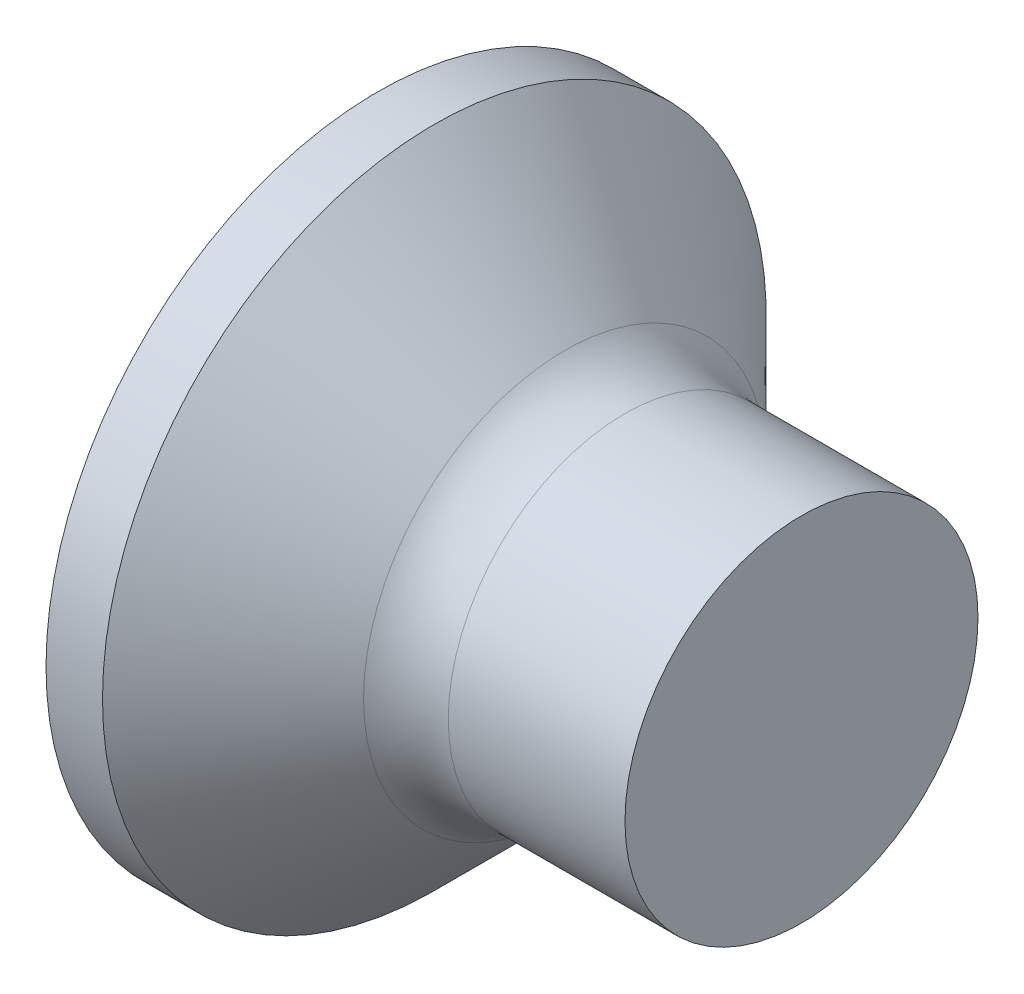
ISO-10303-21;
HEADER;
FILE_DESCRIPTION(('STEP AP214'),'2;1');
FILE_NAME('part.step','',(''),(''),'','','');
FILE_SCHEMA(('AUTOMOTIVE_DESIGN { 1 0 10303 214 1 1 1 1 }'));
ENDSEC;
DATA;
#1=APPLICATION_CONTEXT('core data for automotive mechanical design processes');
#2=APPLICATION_PROTOCOL_DEFINITION('international standard','automotive_design',2000,#1);
#3=PRODUCT_CONTEXT('',#1,'mechanical');
#4=PRODUCT('Part','Part','',(#3));
#5=PRODUCT_RELATED_PRODUCT_CATEGORY('part','',(#4));
#6=PRODUCT_DEFINITION_FORMATION('','',#4);
#7=PRODUCT_DEFINITION_CONTEXT('part definition',#1,'design');
#8=PRODUCT_DEFINITION('design','',#6,#7);
#9=PRODUCT_DEFINITION_SHAPE('','',#8);
#10=(LENGTH_UNIT() NAMED_UNIT(*) SI_UNIT(.MILLI.,.METRE.));
#11=(NAMED_UNIT(*) PLANE_ANGLE_UNIT() SI_UNIT($,.RADIAN.));
#12=(NAMED_UNIT(*) SI_UNIT($,.STERADIAN.) SOLID_ANGLE_UNIT());
#13=UNCERTAINTY_MEASURE_WITH_UNIT(LENGTH_MEASURE(1.E-05),#10,'distance_accuracy_value','');
#14=(GEOMETRIC_REPRESENTATION_CONTEXT(3) GLOBAL_UNCERTAINTY_ASSIGNED_CONTEXT((#13)) GLOBAL_UNIT_ASSIGNED_CONTEXT((#10,
#11,#12)) REPRESENTATION_CONTEXT('',''));
#15=CARTESIAN_POINT('',(0.,0.,0.));
#16=DIRECTION('',(0.,0.,1.));
#17=DIRECTION('',(1.,0.,0.));
#18=AXIS2_PLACEMENT_3D('',#15,#16,#17);
#19=CARTESIAN_POINT('',(1.73,0.,0.));
#20=DIRECTION('',(-1.,0.,0.));
#21=DIRECTION('',(0.,0.,1.));
#22=AXIS2_PLACEMENT_3D('',#19,#20,#21);
#23=CONICAL_SURFACE('',#22,0.556,0.0698131702740412);
#24=CARTESIAN_POINT('',(1.729999999998,-0.415013252800625,-0.37));
#25=CARTESIAN_POINT('',(1.55750312969354,-0.431158403107287,-0.37));
#26=CARTESIAN_POINT('',(1.3849709648995,-0.446919624190215,-0.37));
#27=CARTESIAN_POINT('',(1.03985338175011,-0.477835186856665,-0.37));
#28=CARTESIAN_POINT('',(0.867267963772219,-0.492989532646502,-0.37));
#29=CARTESIAN_POINT('',(0.57890193528168,-0.517935215013628,-0.37));
#30=CARTESIAN_POINT('',(0.463131863825282,-0.527849157578997,-0.37));
#31=CARTESIAN_POINT('',(0.231576539421596,-0.547504590399097,-0.37));
#32=CARTESIAN_POINT('',(0.115791286406975,-0.557246079860979,-0.37));
#33=CARTESIAN_POINT('',(3.84101987284656E-11,-0.566915305839198,-0.37));
#34=B_SPLINE_CURVE_WITH_KNOTS('',3,(#24,#25,#26,#27,#28,#29,#30,#31,#32,#33),.UNSPECIFIED.,.F.,
.F.,(4,2,2,2,4),(0.,0.519751041860774,1.03949848065009,1.38807974296449,1.73666260746019),.UNSPECIFIED.);
#35=CARTESIAN_POINT('',(1.73,-0.415013252766291,-0.370000000038301));
#36=VERTEX_POINT('',#35);
#37=CARTESIAN_POINT('',(1.92040355908633E-11,-0.566915305840776,-0.37));
#38=VERTEX_POINT('',#37);
#39=EDGE_CURVE('E151',#36,#38,#34,.T.);
#40=ORIENTED_EDGE('',*,*,#39,.F.);
#41=CARTESIAN_POINT('',(1.73000000000001,0.,0.));
#42=DIRECTION('',(-1.,0.,0.));
#43=DIRECTION('',(0.,0.,1.));
#44=AXIS2_PLACEMENT_3D('',#41,#42,#43);
#45=CIRCLE('',#44,0.556);
#46=CARTESIAN_POINT('',(1.72999999999915,-0.370000000043595,-0.415013252761651));
#47=VERTEX_POINT('',#46);
#48=EDGE_CURVE('E154',#36,#47,#45,.F.);
#49=ORIENTED_EDGE('',*,*,#48,.T.);
#50=CARTESIAN_POINT('',(3.8564639094538E-11,-0.37,-0.566915305839159));
#51=CARTESIAN_POINT('',(0.210211798320362,-0.37,-0.549344413817544));
#52=CARTESIAN_POINT('',(0.420407070936408,-0.37,-0.53156443555399));
#53=CARTESIAN_POINT('',(0.840738581781578,-0.37,-0.495346236890955));
#54=CARTESIAN_POINT('',(1.05087482059881,-0.37,-0.476908023301598));
#55=CARTESIAN_POINT('',(1.33915479988444,-0.37,-0.450991756887927));
#56=CARTESIAN_POINT('',(1.41733328871563,-0.37,-0.443900811078467));
#57=CARTESIAN_POINT('',(1.57367713363391,-0.37,-0.429572412899283));
#58=CARTESIAN_POINT('',(1.65184248966971,-0.37,-0.422334959970157));
#59=CARTESIAN_POINT('',(1.7299999999983,-0.37,-0.41501325280067));
#60=B_SPLINE_CURVE_WITH_KNOTS('',3,(#50,#51,#52,#53,#54,#55,#56,#57,#58,#59),.UNSPECIFIED.,.F.,
.F.,(4,2,2,2,4),(0.,0.632836028032518,1.26566551061755,1.50116361532924,1.73666261940211),.UNSPECIFIED.);
#61=CARTESIAN_POINT('',(0.,-0.37,-0.566915305842379));
#62=VERTEX_POINT('',#61);
#63=EDGE_CURVE('E173',#62,#47,#60,.T.);
#64=ORIENTED_EDGE('',*,*,#63,.F.);
#65=CARTESIAN_POINT('',(0.,0.,0.));
#66=DIRECTION('',(-1.,0.,0.));
#67=DIRECTION('',(0.,0.,1.));
#68=AXIS2_PLACEMENT_3D('',#65,#66,#67);
#69=CIRCLE('',#68,0.676973385);
#70=EDGE_CURVE('E21',#62,#38,#69,.T.);
#71=ORIENTED_EDGE('',*,*,#70,.T.);
#72=EDGE_LOOP('',(#40,#49,#64,#71));
#73=FACE_BOUND('',#72,.T.);
#74=ADVANCED_FACE('F17',(#73),#23,.F.);
#75=CARTESIAN_POINT('',(0.,-1.40590992,-0.37));
#76=DIRECTION('',(0.,0.,1.));
#77=DIRECTION('',(1.,0.,0.));
#78=AXIS2_PLACEMENT_3D('',#75,#76,#77);
#79=PLANE('',#78);
#80=DIRECTION('',(0.,1.,0.));
#81=VECTOR('',#80,1.);
#82=CARTESIAN_POINT('',(1.73,-0.907506626,-0.37));
#83=LINE('',#82,#81);
#84=CARTESIAN_POINT('',(1.72999999997964,-0.537453962163108,-0.37));
#85=VERTEX_POINT('',#84);
#86=EDGE_CURVE('E153',#85,#36,#83,.T.);
#87=ORIENTED_EDGE('',*,*,#86,.T.);
#88=ORIENTED_EDGE('',*,*,#39,.T.);
#89=DIRECTION('',(0.,-1.,0.));
#90=VECTOR('',#89,1.);
#91=CARTESIAN_POINT('',(0.,-0.907506626,-0.37));
#92=LINE('',#91,#90);
#93=CARTESIAN_POINT('',(4.83501043022083E-11,-1.39999999973373,-0.37));
#94=VERTEX_POINT('',#93);
#95=EDGE_CURVE('E146',#38,#94,#92,.T.);
#96=ORIENTED_EDGE('',*,*,#95,.T.);
#97=DIRECTION('',(-0.894934391333905,-0.446197753476879,0.));
#98=VECTOR('',#97,1.);
#99=CARTESIAN_POINT('',(0.865,-0.968726981,-0.37));
#100=LINE('',#99,#98);
#101=EDGE_CURVE('E149',#85,#94,#100,.T.);
#102=ORIENTED_EDGE('',*,*,#101,.F.);
#103=EDGE_LOOP('',(#87,#88,#96,#102));
#104=FACE_BOUND('',#103,.T.);
#105=ADVANCED_FACE('F148',(#104),#79,.T.);
#106=CARTESIAN_POINT('',(0.,-0.37,-1.40590992));
#107=DIRECTION('',(0.,1.,0.));
#108=DIRECTION('',(0.,0.,1.));
#109=AXIS2_PLACEMENT_3D('',#106,#107,#108);
#110=PLANE('',#109);
#111=DIRECTION('',(0.,0.,1.));
#112=VECTOR('',#111,1.);
#113=CARTESIAN_POINT('',(0.,-0.37,-0.907506626));
#114=LINE('',#113,#112);
#115=CARTESIAN_POINT('',(0.,-0.37,-1.39999999975784));
#116=VERTEX_POINT('',#115);
#117=EDGE_CURVE('E139',#116,#62,#114,.T.);
#118=ORIENTED_EDGE('',*,*,#117,.T.);
#119=ORIENTED_EDGE('',*,*,#63,.T.);
#120=DIRECTION('',(0.,0.,-1.));
#121=VECTOR('',#120,1.);
#122=CARTESIAN_POINT('',(1.73,-0.37,-0.907506626));
#123=LINE('',#122,#121);
#124=CARTESIAN_POINT('',(1.73,-0.37,-0.537453962152957));
#125=VERTEX_POINT('',#124);
#126=EDGE_CURVE('E189',#47,#125,#123,.T.);
#127=ORIENTED_EDGE('',*,*,#126,.T.);
#128=DIRECTION('',(0.894934391333905,0.,0.446197753476879));
#129=VECTOR('',#128,1.);
#130=CARTESIAN_POINT('',(0.865,-0.37,-0.968726981));
#131=LINE('',#130,#129);
#132=EDGE_CURVE('E182',#116,#125,#131,.T.);
#133=ORIENTED_EDGE('',*,*,#132,.F.);
#134=EDGE_LOOP('',(#118,#119,#127,#133));
#135=FACE_BOUND('',#134,.T.);
#136=ADVANCED_FACE('F405',(#135),#110,.T.);
#137=CARTESIAN_POINT('',(1.73,-0.537453962,-0.37));
#138=DIRECTION('',(-0.446197753476879,0.894934391333905,0.));
#139=DIRECTION('',(-0.894934391333905,-0.446197753476879,0.));
#140=AXIS2_PLACEMENT_3D('',#137,#138,#139);
#141=PLANE('',#140);
#142=DIRECTION('',(0.,0.,-1.));
#143=VECTOR('',#142,1.);
#144=CARTESIAN_POINT('',(1.73,-0.537453962,0.));
#145=LINE('',#144,#143);
#146=CARTESIAN_POINT('',(1.73000000000001,-0.537453962182154,-0.142405191389582));
#147=VERTEX_POINT('',#146);
#148=EDGE_CURVE('E163',#147,#85,#145,.T.);
#149=ORIENTED_EDGE('',*,*,#148,.T.);
#150=ORIENTED_EDGE('',*,*,#101,.T.);
#151=DIRECTION('',(0.,0.,1.));
#152=VECTOR('',#151,1.);
#153=CARTESIAN_POINT('',(0.,-1.4,0.));
#154=LINE('',#153,#152);
#155=CARTESIAN_POINT('',(0.,-1.39999999963675,0.37));
#156=VERTEX_POINT('',#155);
#157=EDGE_CURVE('E160',#94,#156,#154,.T.);
#158=ORIENTED_EDGE('',*,*,#157,.T.);
#159=DIRECTION('',(-0.894934391578762,-0.44619775298577,0.));
#160=VECTOR('',#159,1.);
#161=CARTESIAN_POINT('',(1.73,-0.53745396245887,0.37));
#162=LINE('',#161,#160);
#163=CARTESIAN_POINT('',(1.73,-0.537453962229435,0.37));
#164=VERTEX_POINT('',#163);
#165=EDGE_CURVE('E376',#164,#156,#162,.T.);
#166=ORIENTED_EDGE('',*,*,#165,.F.);
#167=DIRECTION('',(0.,0.,-1.));
#168=VECTOR('',#167,1.);
#169=CARTESIAN_POINT('',(1.73,-0.537453962,0.));
#170=LINE('',#169,#168);
#171=CARTESIAN_POINT('',(1.73,-0.537453962165734,0.142405191451554));
#172=VERTEX_POINT('',#171);
#173=EDGE_CURVE('E172',#164,#172,#170,.T.);
#174=ORIENTED_EDGE('',*,*,#173,.T.);
#175=CARTESIAN_POINT('',(2.67005397689074,-0.0687604167553468,0.));
#176=DIRECTION('',(-0.446197753476879,0.894934391333905,0.));
#177=DIRECTION('',(-0.894934391333905,-0.446197753476879,0.));
#178=AXIS2_PLACEMENT_3D('',#175,#176,#177);
#179=ELLIPSE('',#178,1.09876172830792,0.485419189775482);
#180=EDGE_CURVE('E175',#172,#147,#179,.F.);
#181=ORIENTED_EDGE('',*,*,#180,.T.);
#182=EDGE_LOOP('',(#149,#150,#158,#166,#174,#181));
#183=FACE_BOUND('',#182,.T.);
#184=ADVANCED_FACE('F158',(#183),#141,.T.);
#185=CARTESIAN_POINT('',(0.,-0.37,-1.4));
#186=DIRECTION('',(-0.446197753476879,0.,0.894934391333905));
#187=DIRECTION('',(0.894934391333905,0.,0.446197753476879));
#188=AXIS2_PLACEMENT_3D('',#185,#186,#187);
#189=PLANE('',#188);
#190=DIRECTION('',(0.,1.,0.));
#191=VECTOR('',#190,1.);
#192=CARTESIAN_POINT('',(1.73,0.,-0.537453962));
#193=LINE('',#192,#191);
#194=CARTESIAN_POINT('',(1.73000000000001,0.142405191444702,-0.537453962167549));
#195=VERTEX_POINT('',#194);
#196=CARTESIAN_POINT('',(1.73,0.37,-0.537453962229435));
#197=VERTEX_POINT('',#196);
#198=EDGE_CURVE('E379',#195,#197,#193,.T.);
#199=ORIENTED_EDGE('',*,*,#198,.T.);
#200=DIRECTION('',(0.894934391578762,0.,0.44619775298577));
#201=VECTOR('',#200,1.);
#202=CARTESIAN_POINT('',(0.,0.37,-1.39999999927351));
#203=LINE('',#202,#201);
#204=CARTESIAN_POINT('',(0.,0.37,-1.39999999963675));
#205=VERTEX_POINT('',#204);
#206=EDGE_CURVE('E372',#205,#197,#203,.T.);
#207=ORIENTED_EDGE('',*,*,#206,.F.);
#208=DIRECTION('',(0.,-1.,0.));
#209=VECTOR('',#208,1.);
#210=CARTESIAN_POINT('',(0.,0.,-1.4));
#211=LINE('',#210,#209);
#212=EDGE_CURVE('E165',#205,#116,#211,.T.);
#213=ORIENTED_EDGE('',*,*,#212,.T.);
#214=ORIENTED_EDGE('',*,*,#132,.T.);
#215=DIRECTION('',(0.,1.,0.));
#216=VECTOR('',#215,1.);
#217=CARTESIAN_POINT('',(1.73,0.,-0.537453962));
#218=LINE('',#217,#216);
#219=CARTESIAN_POINT('',(1.73000000000001,-0.142405191396442,-0.537453962180336));
#220=VERTEX_POINT('',#219);
#221=EDGE_CURVE('E185',#125,#220,#218,.T.);
#222=ORIENTED_EDGE('',*,*,#221,.T.);
#223=CARTESIAN_POINT('',(2.67005397689074,0.,-0.0687604167553468));
#224=DIRECTION('',(-0.446197753476879,0.,0.894934391333905));
#225=DIRECTION('',(-0.894934391333905,0.,-0.446197753476879));
#226=AXIS2_PLACEMENT_3D('',#223,#224,#225);
#227=ELLIPSE('',#226,1.09876172830792,0.485419189775482);
#228=EDGE_CURVE('E381',#220,#195,#227,.F.);
#229=ORIENTED_EDGE('',*,*,#228,.T.);
#230=EDGE_LOOP('',(#199,#207,#213,#214,#222,#229));
#231=FACE_BOUND('',#230,.T.);
#232=ADVANCED_FACE('F424',(#231),#189,.T.);
#233=CARTESIAN_POINT('',(0.,-1.40590992,0.37));
#234=DIRECTION('',(0.,0.,-1.));
#235=DIRECTION('',(0.,1.,0.));
#236=AXIS2_PLACEMENT_3D('',#233,#234,#235);
#237=PLANE('',#236);
#238=DIRECTION('',(0.,1.,0.));
#239=VECTOR('',#238,1.);
#240=CARTESIAN_POINT('',(0.,-0.907506626,0.37));
#241=LINE('',#240,#239);
#242=CARTESIAN_POINT('',(1.22135406838788E-11,-0.566915305841359,0.37));
#243=VERTEX_POINT('',#242);
#244=EDGE_CURVE('E171',#156,#243,#241,.T.);
#245=ORIENTED_EDGE('',*,*,#244,.T.);
#246=CARTESIAN_POINT('',(1.73000000000188,-0.415013252800262,0.37));
#247=CARTESIAN_POINT('',(1.5575031296975,-0.431158403106922,0.37));
#248=CARTESIAN_POINT('',(1.38497096490355,-0.446919624189848,0.37));
#249=CARTESIAN_POINT('',(1.03985338175432,-0.477835186856293,0.37));
#250=CARTESIAN_POINT('',(0.867267963776517,-0.492989532646126,0.37));
#251=CARTESIAN_POINT('',(0.578901935283002,-0.517935215013516,0.37));
#252=CARTESIAN_POINT('',(0.463131863823544,-0.527849157579147,0.37));
#253=CARTESIAN_POINT('',(0.231576539413737,-0.547504590399762,0.37));
#254=CARTESIAN_POINT('',(0.115791286396055,-0.557246079861896,0.37));
#255=CARTESIAN_POINT('',(2.44294313152273E-11,-0.566915305840365,0.37));
#256=B_SPLINE_CURVE_WITH_KNOTS('',3,(#246,#247,#248,#249,#250,#251,#252,#253,#254,#255),
.UNSPECIFIED.,.F.,.F.,(4,2,2,2,4),(0.,0.519751041860521,1.03949848064959,1.3880797429732,
1.73666260747812),.UNSPECIFIED.);
#257=CARTESIAN_POINT('',(1.73,-0.415013252723627,0.370000000086156));
#258=VERTEX_POINT('',#257);
#259=EDGE_CURVE('E369',#258,#243,#256,.T.);
#260=ORIENTED_EDGE('',*,*,#259,.F.);
#261=DIRECTION('',(0.,-1.,0.));
#262=VECTOR('',#261,1.);
#263=CARTESIAN_POINT('',(1.73,-0.907506626,0.37));
#264=LINE('',#263,#262);
#265=EDGE_CURVE('E377',#258,#164,#264,.T.);
#266=ORIENTED_EDGE('',*,*,#265,.T.);
#267=ORIENTED_EDGE('',*,*,#165,.T.);
#268=EDGE_LOOP('',(#245,#260,#266,#267));
#269=FACE_BOUND('',#268,.T.);
#270=ADVANCED_FACE('F428',(#269),#237,.T.);
#271=CARTESIAN_POINT('',(0.,0.37,-0.409103332));
#272=DIRECTION('',(0.,-1.,0.));
#273=DIRECTION('',(0.,0.,-1.));
#274=AXIS2_PLACEMENT_3D('',#271,#272,#273);
#275=PLANE('',#274);
#276=DIRECTION('',(0.,0.,1.));
#277=VECTOR('',#276,1.);
#278=CARTESIAN_POINT('',(1.73,0.37,-0.907506626));
#279=LINE('',#278,#277);
#280=CARTESIAN_POINT('',(1.73,0.370000000080861,-0.415013252728347));
#281=VERTEX_POINT('',#280);
#282=EDGE_CURVE('E370',#197,#281,#279,.T.);
#283=ORIENTED_EDGE('',*,*,#282,.T.);
#284=CARTESIAN_POINT('',(2.41138960563302E-11,0.37,-0.566915305840366));
#285=CARTESIAN_POINT('',(0.210211798306226,0.37,-0.549344413818736));
#286=CARTESIAN_POINT('',(0.420407070922587,0.37,-0.531564435555168));
#287=CARTESIAN_POINT('',(0.840738581768387,0.37,-0.495346236892106));
#288=CARTESIAN_POINT('',(1.05087482058593,0.37,-0.476908023302737));
#289=CARTESIAN_POINT('',(1.3391547998745,0.37,-0.450991756888827));
#290=CARTESIAN_POINT('',(1.41733328870831,0.37,-0.443900811079136));
#291=CARTESIAN_POINT('',(1.57367713363182,0.37,-0.429572412899478));
#292=CARTESIAN_POINT('',(1.65184248967024,0.37,-0.42233495997011));
#293=CARTESIAN_POINT('',(1.73000000000145,0.37,-0.415013252800375));
#294=B_SPLINE_CURVE_WITH_KNOTS('',3,(#284,#285,#286,#287,#288,#289,#290,#291,#292,#293),
.UNSPECIFIED.,.F.,.F.,(4,2,2,2,4),(0.,0.632836028033464,1.26566551061944,1.50116361533902,
1.73666261941977),.UNSPECIFIED.);
#295=CARTESIAN_POINT('',(0.,0.37,-0.566915305842379));
#296=VERTEX_POINT('',#295);
#297=EDGE_CURVE('E366',#296,#281,#294,.T.);
#298=ORIENTED_EDGE('',*,*,#297,.F.);
#299=DIRECTION('',(0.,0.,-1.));
#300=VECTOR('',#299,1.);
#301=CARTESIAN_POINT('',(0.,0.37,-0.907506626));
#302=LINE('',#301,#300);
#303=EDGE_CURVE('E373',#296,#205,#302,.T.);
#304=ORIENTED_EDGE('',*,*,#303,.T.);
#305=ORIENTED_EDGE('',*,*,#206,.T.);
#306=EDGE_LOOP('',(#283,#298,#304,#305));
#307=FACE_BOUND('',#306,.T.);
#308=ADVANCED_FACE('F435',(#307),#275,.T.);
#309=CARTESIAN_POINT('',(1.73,0.,0.));
#310=DIRECTION('',(-1.,0.,0.));
#311=DIRECTION('',(0.,0.,1.));
#312=AXIS2_PLACEMENT_3D('',#309,#310,#311);
#313=CONICAL_SURFACE('',#312,0.556,0.0698131702740412);
#314=ORIENTED_EDGE('',*,*,#259,.T.);
#315=CARTESIAN_POINT('',(0.,0.,0.));
#316=DIRECTION('',(-1.,0.,0.));
#317=DIRECTION('',(0.,0.,1.));
#318=AXIS2_PLACEMENT_3D('',#315,#316,#317);
#319=CIRCLE('',#318,0.676973385);
#320=CARTESIAN_POINT('',(2.16429129721368E-11,-0.37,0.566915305840572));
#321=VERTEX_POINT('',#320);
#322=EDGE_CURVE('E446',#243,#321,#319,.T.);
#323=ORIENTED_EDGE('',*,*,#322,.T.);
#324=CARTESIAN_POINT('',(1.72999999998696,-0.37,0.415013252801659));
#325=CARTESIAN_POINT('',(1.55750312968226,-0.37,0.431158403108326));
#326=CARTESIAN_POINT('',(1.38497096488798,-0.37,0.446919624191261));
#327=CARTESIAN_POINT('',(1.03985338173811,-0.37,0.477835186857727));
#328=CARTESIAN_POINT('',(0.867267963759975,-0.37,0.492989532647572));
#329=CARTESIAN_POINT('',(0.578901935272125,-0.37,0.517935215014448));
#330=CARTESIAN_POINT('',(0.463131863818658,-0.37,0.527849157579561));
#331=CARTESIAN_POINT('',(0.231576539420833,-0.37,0.54750459039916));
#332=CARTESIAN_POINT('',(0.115791286409143,-0.37,0.557246079860795));
#333=CARTESIAN_POINT('',(4.35104937894774E-11,-0.37,0.566915305838772));
#334=B_SPLINE_CURVE_WITH_KNOTS('',3,(#324,#325,#326,#327,#328,#329,#330,#331,#332,#333),
.UNSPECIFIED.,.F.,.F.,(4,2,2,2,4),(0.,0.519751041861496,1.03949848065153,1.38807974295711,
1.73666260744399),.UNSPECIFIED.);
#335=CARTESIAN_POINT('',(1.72999999999349,-0.36999999999574,0.415013252804846));
#336=VERTEX_POINT('',#335);
#337=EDGE_CURVE('E351',#336,#321,#334,.T.);
#338=ORIENTED_EDGE('',*,*,#337,.F.);
#339=CARTESIAN_POINT('',(1.73000000000001,0.,0.));
#340=DIRECTION('',(-1.,0.,0.));
#341=DIRECTION('',(0.,0.,1.));
#342=AXIS2_PLACEMENT_3D('',#339,#340,#341);
#343=CIRCLE('',#342,0.556);
#344=EDGE_CURVE('E367',#336,#258,#343,.F.);
#345=ORIENTED_EDGE('',*,*,#344,.T.);
#346=EDGE_LOOP('',(#314,#323,#338,#345));
#347=FACE_BOUND('',#346,.T.);
#348=ADVANCED_FACE('F412',(#347),#313,.F.);
#349=CARTESIAN_POINT('',(1.73,0.,0.));
#350=DIRECTION('',(-1.,0.,0.));
#351=DIRECTION('',(0.,0.,1.));
#352=AXIS2_PLACEMENT_3D('',#349,#350,#351);
#353=CONICAL_SURFACE('',#352,0.556,0.0698131702740412);
#354=CARTESIAN_POINT('',(3.72916180636838E-11,0.566915305765091,-0.36999999986375));
#355=CARTESIAN_POINT('',(0.210211798323191,0.549344413791461,-0.369999999952531));
#356=CARTESIAN_POINT('',(0.420407070940878,0.531564435546869,-0.36999999998762));
#357=CARTESIAN_POINT('',(0.840738581787213,0.495346236897205,-0.37000000001238));
#358=CARTESIAN_POINT('',(1.05087482060397,0.476908023302259,-0.370000000002053));
#359=CARTESIAN_POINT('',(1.33915479988823,0.450991756887168,-0.369999999999236));
#360=CARTESIAN_POINT('',(1.4173332887182,0.443900811078025,-0.369999999999618));
#361=CARTESIAN_POINT('',(1.57367713363404,0.429572412899479,-0.370000000000382));
#362=CARTESIAN_POINT('',(1.65184248966863,0.422334959970673,-0.370000000000764));
#363=CARTESIAN_POINT('',(1.72999999999595,0.41501325280089,-0.37));
#364=B_SPLINE_CURVE_WITH_KNOTS('',3,(#354,#355,#356,#357,#358,#359,#360,#361,#362,#363),
.UNSPECIFIED.,.F.,.F.,(4,2,2,2,4),(0.,0.63283602803262,1.26566551061764,1.5011636153256,
1.73666261939476),.UNSPECIFIED.);
#365=CARTESIAN_POINT('',(0.,0.566915305842379,-0.37));
#366=VERTEX_POINT('',#365);
#367=CARTESIAN_POINT('',(1.72999999999798,0.415013252799705,-0.370000000001035));
#368=VERTEX_POINT('',#367);
#369=EDGE_CURVE('E336',#366,#368,#364,.T.);
#370=ORIENTED_EDGE('',*,*,#369,.F.);
#371=CARTESIAN_POINT('',(0.,0.,0.));
#372=DIRECTION('',(-1.,0.,0.));
#373=DIRECTION('',(0.,0.,1.));
#374=AXIS2_PLACEMENT_3D('',#371,#372,#373);
#375=CIRCLE('',#374,0.676973385);
#376=EDGE_CURVE('E357',#366,#296,#375,.T.);
#377=ORIENTED_EDGE('',*,*,#376,.T.);
#378=ORIENTED_EDGE('',*,*,#297,.T.);
#379=CARTESIAN_POINT('',(1.73000000000001,0.,0.));
#380=DIRECTION('',(-1.,0.,0.));
#381=DIRECTION('',(0.,0.,1.));
#382=AXIS2_PLACEMENT_3D('',#379,#380,#381);
#383=CIRCLE('',#382,0.556);
#384=EDGE_CURVE('E364',#281,#368,#383,.F.);
#385=ORIENTED_EDGE('',*,*,#384,.T.);
#386=EDGE_LOOP('',(#370,#377,#378,#385));
#387=FACE_BOUND('',#386,.T.);
#388=ADVANCED_FACE('F480',(#387),#353,.F.);
#389=CARTESIAN_POINT('',(0.,-0.37,0.409103332));
#390=DIRECTION('',(0.,1.,0.));
#391=DIRECTION('',(0.,0.,1.));
#392=AXIS2_PLACEMENT_3D('',#389,#390,#391);
#393=PLANE('',#392);
#394=DIRECTION('',(0.,0.,-1.));
#395=VECTOR('',#394,1.);
#396=CARTESIAN_POINT('',(1.73,-0.37,0.4758662855));
#397=LINE('',#396,#395);
#398=CARTESIAN_POINT('',(1.72999999997964,-0.37,0.537453962010151));
#399=VERTEX_POINT('',#398);
#400=EDGE_CURVE('E326',#399,#336,#397,.T.);
#401=ORIENTED_EDGE('',*,*,#400,.T.);
#402=ORIENTED_EDGE('',*,*,#337,.T.);
#403=DIRECTION('',(0.,0.,1.));
#404=VECTOR('',#403,1.);
#405=CARTESIAN_POINT('',(0.,-0.37,0.907506626));
#406=LINE('',#405,#404);
#407=CARTESIAN_POINT('',(4.83501043022083E-11,-0.37,1.39999999973373));
#408=VERTEX_POINT('',#407);
#409=EDGE_CURVE('E354',#321,#408,#406,.T.);
#410=ORIENTED_EDGE('',*,*,#409,.T.);
#411=DIRECTION('',(-0.894934391333905,0.,0.446197753476879));
#412=VECTOR('',#411,1.);
#413=CARTESIAN_POINT('',(0.865,-0.37,0.968726981));
#414=LINE('',#413,#412);
#415=EDGE_CURVE('E316',#399,#408,#414,.T.);
#416=ORIENTED_EDGE('',*,*,#415,.F.);
#417=EDGE_LOOP('',(#401,#402,#410,#416));
#418=FACE_BOUND('',#417,.T.);
#419=ADVANCED_FACE('F483',(#418),#393,.T.);
#420=CARTESIAN_POINT('',(0.,0.409103332,-0.37));
#421=DIRECTION('',(0.,0.,1.));
#422=DIRECTION('',(1.,0.,0.));
#423=AXIS2_PLACEMENT_3D('',#420,#421,#422);
#424=PLANE('',#423);
#425=DIRECTION('',(0.,-1.,0.));
#426=VECTOR('',#425,1.);
#427=CARTESIAN_POINT('',(0.,0.907506626,-0.37));
#428=LINE('',#427,#426);
#429=CARTESIAN_POINT('',(0.,1.39999999975784,-0.37));
#430=VERTEX_POINT('',#429);
#431=EDGE_CURVE('E344',#430,#366,#428,.T.);
#432=ORIENTED_EDGE('',*,*,#431,.T.);
#433=ORIENTED_EDGE('',*,*,#369,.T.);
#434=DIRECTION('',(0.,1.,0.));
#435=VECTOR('',#434,1.);
#436=CARTESIAN_POINT('',(1.73,0.907506626,-0.37));
#437=LINE('',#436,#435);
#438=CARTESIAN_POINT('',(1.73,0.537453962152957,-0.37));
#439=VERTEX_POINT('',#438);
#440=EDGE_CURVE('E346',#368,#439,#437,.T.);
#441=ORIENTED_EDGE('',*,*,#440,.T.);
#442=DIRECTION('',(0.894934391333905,-0.446197753476879,0.));
#443=VECTOR('',#442,1.);
#444=CARTESIAN_POINT('',(0.865,0.968726981,-0.37));
#445=LINE('',#444,#443);
#446=EDGE_CURVE('E315',#430,#439,#445,.T.);
#447=ORIENTED_EDGE('',*,*,#446,.F.);
#448=EDGE_LOOP('',(#432,#433,#441,#447));
#449=FACE_BOUND('',#448,.T.);
#450=ADVANCED_FACE('F505',(#449),#424,.T.);
#451=CARTESIAN_POINT('',(1.73,-0.37,-0.414278609));
#452=DIRECTION('',(1.,0.,0.));
#453=DIRECTION('',(0.,0.,-1.));
#454=AXIS2_PLACEMENT_3D('',#451,#452,#453);
#455=PLANE('',#454);
#456=ORIENTED_EDGE('',*,*,#126,.F.);
#457=CARTESIAN_POINT('',(1.73,0.,0.));
#458=DIRECTION('',(-1.,0.,0.));
#459=DIRECTION('',(0.,0.,1.));
#460=AXIS2_PLACEMENT_3D('',#457,#458,#459);
#461=CIRCLE('',#460,0.556);
#462=EDGE_CURVE('E331',#220,#47,#461,.T.);
#463=ORIENTED_EDGE('',*,*,#462,.F.);
#464=ORIENTED_EDGE('',*,*,#221,.F.);
#465=EDGE_LOOP('',(#456,#463,#464));
#466=FACE_BOUND('',#465,.T.);
#467=ADVANCED_FACE('F474',(#466),#455,.F.);
#468=CARTESIAN_POINT('',(1.73,-0.537453962,-0.141039622));
#469=DIRECTION('',(1.,0.,0.));
#470=DIRECTION('',(0.,0.,-1.));
#471=AXIS2_PLACEMENT_3D('',#468,#469,#470);
#472=PLANE('',#471);
#473=ORIENTED_EDGE('',*,*,#148,.F.);
#474=CARTESIAN_POINT('',(1.73,0.,0.));
#475=DIRECTION('',(-1.,0.,0.));
#476=DIRECTION('',(0.,0.,1.));
#477=AXIS2_PLACEMENT_3D('',#474,#475,#476);
#478=CIRCLE('',#477,0.556);
#479=EDGE_CURVE('E343',#36,#147,#478,.T.);
#480=ORIENTED_EDGE('',*,*,#479,.F.);
#481=ORIENTED_EDGE('',*,*,#86,.F.);
#482=EDGE_LOOP('',(#473,#480,#481));
#483=FACE_BOUND('',#482,.T.);
#484=ADVANCED_FACE('F466',(#483),#472,.F.);
#485=CARTESIAN_POINT('',(1.73,0.,0.));
#486=DIRECTION('',(-1.,0.,0.));
#487=DIRECTION('',(0.,0.,1.));
#488=AXIS2_PLACEMENT_3D('',#485,#486,#487);
#489=CONICAL_SURFACE('',#488,0.556,0.0698131780868004);
#490=ORIENTED_EDGE('',*,*,#180,.F.);
#491=CARTESIAN_POINT('',(1.73000000000001,0.,0.));
#492=DIRECTION('',(-1.,0.,0.));
#493=DIRECTION('',(0.,0.,1.));
#494=AXIS2_PLACEMENT_3D('',#491,#492,#493);
#495=CIRCLE('',#494,0.556);
#496=EDGE_CURVE('E339',#147,#172,#495,.T.);
#497=ORIENTED_EDGE('',*,*,#496,.F.);
#498=EDGE_LOOP('',(#490,#497));
#499=FACE_BOUND('',#498,.T.);
#500=ADVANCED_FACE('F464',(#499),#489,.F.);
#501=CARTESIAN_POINT('',(1.73,-0.537453962,0.37));
#502=DIRECTION('',(1.,0.,0.));
#503=DIRECTION('',(0.,0.,-1.));
#504=AXIS2_PLACEMENT_3D('',#501,#502,#503);
#505=PLANE('',#504);
#506=ORIENTED_EDGE('',*,*,#265,.F.);
#507=CARTESIAN_POINT('',(1.73,0.,0.));
#508=DIRECTION('',(-1.,0.,0.));
#509=DIRECTION('',(0.,0.,1.));
#510=AXIS2_PLACEMENT_3D('',#507,#508,#509);
#511=CIRCLE('',#510,0.556);
#512=EDGE_CURVE('E342',#172,#258,#511,.T.);
#513=ORIENTED_EDGE('',*,*,#512,.F.);
#514=ORIENTED_EDGE('',*,*,#173,.F.);
#515=EDGE_LOOP('',(#506,#513,#514));
#516=FACE_BOUND('',#515,.T.);
#517=ADVANCED_FACE('F455',(#516),#505,.F.);
#518=CARTESIAN_POINT('',(1.73,-0.37,0.537453962));
#519=DIRECTION('',(1.,0.,0.));
#520=DIRECTION('',(0.,0.,-1.));
#521=AXIS2_PLACEMENT_3D('',#518,#519,#520);
#522=PLANE('',#521);
#523=DIRECTION('',(0.,-1.,0.));
#524=VECTOR('',#523,1.);
#525=CARTESIAN_POINT('',(1.73,0.,0.537453962));
#526=LINE('',#525,#524);
#527=CARTESIAN_POINT('',(1.73000000000001,-0.142405191603188,0.537453962125557));
#528=VERTEX_POINT('',#527);
#529=EDGE_CURVE('E319',#528,#399,#526,.T.);
#530=ORIENTED_EDGE('',*,*,#529,.F.);
#531=CARTESIAN_POINT('',(1.73,0.,0.));
#532=DIRECTION('',(-1.,0.,0.));
#533=DIRECTION('',(0.,0.,1.));
#534=AXIS2_PLACEMENT_3D('',#531,#532,#533);
#535=CIRCLE('',#534,0.556);
#536=EDGE_CURVE('E457',#336,#528,#535,.T.);
#537=ORIENTED_EDGE('',*,*,#536,.F.);
#538=ORIENTED_EDGE('',*,*,#400,.F.);
#539=EDGE_LOOP('',(#530,#537,#538));
#540=FACE_BOUND('',#539,.T.);
#541=ADVANCED_FACE('F472',(#540),#522,.F.);
#542=CARTESIAN_POINT('',(1.73,-0.37,0.537453962));
#543=DIRECTION('',(-0.446197753476879,0.,-0.894934391333905));
#544=DIRECTION('',(-0.894934391333905,0.,0.446197753476879));
#545=AXIS2_PLACEMENT_3D('',#542,#543,#544);
#546=PLANE('',#545);
#547=ORIENTED_EDGE('',*,*,#529,.T.);
#548=ORIENTED_EDGE('',*,*,#415,.T.);
#549=DIRECTION('',(0.,1.,0.));
#550=VECTOR('',#549,1.);
#551=CARTESIAN_POINT('',(0.,0.,1.4));
#552=LINE('',#551,#550);
#553=CARTESIAN_POINT('',(0.,0.37,1.39999999963675));
#554=VERTEX_POINT('',#553);
#555=EDGE_CURVE('E322',#408,#554,#552,.T.);
#556=ORIENTED_EDGE('',*,*,#555,.T.);
#557=DIRECTION('',(-0.894934391578762,0.,0.44619775298577));
#558=VECTOR('',#557,1.);
#559=CARTESIAN_POINT('',(1.73,0.37,0.53745396245887));
#560=LINE('',#559,#558);
#561=CARTESIAN_POINT('',(1.73,0.37,0.537453962229435));
#562=VERTEX_POINT('',#561);
#563=EDGE_CURVE('E278',#562,#554,#560,.T.);
#564=ORIENTED_EDGE('',*,*,#563,.F.);
#565=DIRECTION('',(0.,-1.,0.));
#566=VECTOR('',#565,1.);
#567=CARTESIAN_POINT('',(1.73,0.255519811,0.537453962));
#568=LINE('',#567,#566);
#569=CARTESIAN_POINT('',(1.73000000000001,0.142405191554928,0.537453962138344));
#570=VERTEX_POINT('',#569);
#571=EDGE_CURVE('E303',#562,#570,#568,.T.);
#572=ORIENTED_EDGE('',*,*,#571,.T.);
#573=CARTESIAN_POINT('',(2.67005397689074,0.,0.0687604167553468));
#574=DIRECTION('',(-0.446197753476879,0.,-0.894934391333905));
#575=DIRECTION('',(-0.894934391333905,0.,0.446197753476879));
#576=AXIS2_PLACEMENT_3D('',#573,#574,#575);
#577=ELLIPSE('',#576,1.09876172830792,0.485419189775482);
#578=EDGE_CURVE('E306',#528,#570,#577,.T.);
#579=ORIENTED_EDGE('',*,*,#578,.F.);
#580=EDGE_LOOP('',(#547,#548,#556,#564,#572,#579));
#581=FACE_BOUND('',#580,.T.);
#582=ADVANCED_FACE('F516',(#581),#546,.T.);
#583=CARTESIAN_POINT('',(0.,1.4,-0.37));
#584=DIRECTION('',(-0.446197753476879,-0.894934391333905,0.));
#585=DIRECTION('',(0.894934391333905,-0.446197753476879,0.));
#586=AXIS2_PLACEMENT_3D('',#583,#584,#585);
#587=PLANE('',#586);
#588=DIRECTION('',(0.,0.,1.));
#589=VECTOR('',#588,1.);
#590=CARTESIAN_POINT('',(1.73,0.537453962,0.255519811));
#591=LINE('',#590,#589);
#592=CARTESIAN_POINT('',(1.73,0.537453962152947,0.142405191499814));
#593=VERTEX_POINT('',#592);
#594=CARTESIAN_POINT('',(1.73,0.537453962229435,0.37));
#595=VERTEX_POINT('',#594);
#596=EDGE_CURVE('E300',#593,#595,#591,.T.);
#597=ORIENTED_EDGE('',*,*,#596,.T.);
#598=DIRECTION('',(0.894934391578762,-0.44619775298577,0.));
#599=VECTOR('',#598,1.);
#600=CARTESIAN_POINT('',(0.,1.39999999927351,0.37));
#601=LINE('',#600,#599);
#602=CARTESIAN_POINT('',(0.,1.39999999963675,0.37));
#603=VERTEX_POINT('',#602);
#604=EDGE_CURVE('E272',#603,#595,#601,.T.);
#605=ORIENTED_EDGE('',*,*,#604,.F.);
#606=DIRECTION('',(0.,0.,-1.));
#607=VECTOR('',#606,1.);
#608=CARTESIAN_POINT('',(0.,1.4,0.));
#609=LINE('',#608,#607);
#610=EDGE_CURVE('E312',#603,#430,#609,.T.);
#611=ORIENTED_EDGE('',*,*,#610,.T.);
#612=ORIENTED_EDGE('',*,*,#446,.T.);
#613=DIRECTION('',(0.,0.,1.));
#614=VECTOR('',#613,1.);
#615=CARTESIAN_POINT('',(1.73,0.537453962,-0.255519811));
#616=LINE('',#615,#614);
#617=CARTESIAN_POINT('',(1.73000000000001,0.537453962123739,-0.142405191610049));
#618=VERTEX_POINT('',#617);
#619=EDGE_CURVE('E282',#439,#618,#616,.T.);
#620=ORIENTED_EDGE('',*,*,#619,.T.);
#621=CARTESIAN_POINT('',(2.67005397689074,0.0687604167553468,0.));
#622=DIRECTION('',(-0.446197753476879,-0.894934391333905,0.));
#623=DIRECTION('',(-0.894934391333905,0.446197753476879,0.));
#624=AXIS2_PLACEMENT_3D('',#621,#622,#623);
#625=ELLIPSE('',#624,1.09876172830792,0.485419189775482);
#626=EDGE_CURVE('E292',#593,#618,#625,.T.);
#627=ORIENTED_EDGE('',*,*,#626,.F.);
#628=EDGE_LOOP('',(#597,#605,#611,#612,#620,#627));
#629=FACE_BOUND('',#628,.T.);
#630=ADVANCED_FACE('F520',(#629),#587,.T.);
#631=CARTESIAN_POINT('',(1.73,0.,0.));
#632=DIRECTION('',(-1.,0.,0.));
#633=DIRECTION('',(0.,0.,1.));
#634=AXIS2_PLACEMENT_3D('',#631,#632,#633);
#635=CONICAL_SURFACE('',#634,0.556,0.0698131780868004);
#636=CARTESIAN_POINT('',(1.73000000000001,0.,0.));
#637=DIRECTION('',(-1.,0.,0.));
#638=DIRECTION('',(0.,0.,1.));
#639=AXIS2_PLACEMENT_3D('',#636,#637,#638);
#640=CIRCLE('',#639,0.556);
#641=EDGE_CURVE('E271',#528,#570,#640,.T.);
#642=ORIENTED_EDGE('',*,*,#641,.F.);
#643=ORIENTED_EDGE('',*,*,#578,.T.);
#644=EDGE_LOOP('',(#642,#643));
#645=FACE_BOUND('',#644,.T.);
#646=ADVANCED_FACE('F478',(#645),#635,.F.);
#647=CARTESIAN_POINT('',(1.73,0.141039622,0.537453962));
#648=DIRECTION('',(1.,0.,0.));
#649=DIRECTION('',(0.,0.,-1.));
#650=AXIS2_PLACEMENT_3D('',#647,#648,#649);
#651=PLANE('',#650);
#652=DIRECTION('',(0.,0.,1.));
#653=VECTOR('',#652,1.);
#654=CARTESIAN_POINT('',(1.73,0.37,0.907506626));
#655=LINE('',#654,#653);
#656=CARTESIAN_POINT('',(1.73,0.369999999958475,0.415013252837459));
#657=VERTEX_POINT('',#656);
#658=EDGE_CURVE('E279',#657,#562,#655,.T.);
#659=ORIENTED_EDGE('',*,*,#658,.F.);
#660=CARTESIAN_POINT('',(1.73,0.,0.));
#661=DIRECTION('',(-1.,0.,0.));
#662=DIRECTION('',(0.,0.,1.));
#663=AXIS2_PLACEMENT_3D('',#660,#661,#662);
#664=CIRCLE('',#663,0.556);
#665=EDGE_CURVE('E309',#570,#657,#664,.T.);
#666=ORIENTED_EDGE('',*,*,#665,.F.);
#667=ORIENTED_EDGE('',*,*,#571,.F.);
#668=EDGE_LOOP('',(#659,#666,#667));
#669=FACE_BOUND('',#668,.T.);
#670=ADVANCED_FACE('F525',(#669),#651,.F.);
#671=CARTESIAN_POINT('',(1.73,0.414278609,0.37));
#672=DIRECTION('',(1.,0.,0.));
#673=DIRECTION('',(0.,0.,-1.));
#674=AXIS2_PLACEMENT_3D('',#671,#672,#673);
#675=PLANE('',#674);
#676=ORIENTED_EDGE('',*,*,#596,.F.);
#677=CARTESIAN_POINT('',(1.73,0.,0.));
#678=DIRECTION('',(-1.,0.,0.));
#679=DIRECTION('',(0.,0.,1.));
#680=AXIS2_PLACEMENT_3D('',#677,#678,#679);
#681=CIRCLE('',#680,0.556);
#682=CARTESIAN_POINT('',(1.73,0.415013252875403,0.369999999915914));
#683=VERTEX_POINT('',#682);
#684=EDGE_CURVE('E299',#683,#593,#681,.T.);
#685=ORIENTED_EDGE('',*,*,#684,.F.);
#686=DIRECTION('',(0.,-1.,0.));
#687=VECTOR('',#686,1.);
#688=CARTESIAN_POINT('',(1.73,0.907506626,0.37));
#689=LINE('',#688,#687);
#690=EDGE_CURVE('E269',#595,#683,#689,.T.);
#691=ORIENTED_EDGE('',*,*,#690,.F.);
#692=EDGE_LOOP('',(#676,#685,#691));
#693=FACE_BOUND('',#692,.T.);
#694=ADVANCED_FACE('F528',(#693),#675,.F.);
#695=CARTESIAN_POINT('',(1.73,0.,0.));
#696=DIRECTION('',(-1.,0.,0.));
#697=DIRECTION('',(0.,0.,1.));
#698=AXIS2_PLACEMENT_3D('',#695,#696,#697);
#699=CONICAL_SURFACE('',#698,0.556,0.0698131780868004);
#700=ORIENTED_EDGE('',*,*,#626,.T.);
#701=CARTESIAN_POINT('',(1.73000000000001,0.,0.));
#702=DIRECTION('',(-1.,0.,0.));
#703=DIRECTION('',(0.,0.,1.));
#704=AXIS2_PLACEMENT_3D('',#701,#702,#703);
#705=CIRCLE('',#704,0.556);
#706=EDGE_CURVE('E295',#593,#618,#705,.T.);
#707=ORIENTED_EDGE('',*,*,#706,.F.);
#708=EDGE_LOOP('',(#700,#707));
#709=FACE_BOUND('',#708,.T.);
#710=ADVANCED_FACE('F532',(#709),#699,.F.);
#711=CARTESIAN_POINT('',(1.73,0.414278609,-0.141039622));
#712=DIRECTION('',(1.,0.,0.));
#713=DIRECTION('',(0.,0.,-1.));
#714=AXIS2_PLACEMENT_3D('',#711,#712,#713);
#715=PLANE('',#714);
#716=ORIENTED_EDGE('',*,*,#440,.F.);
#717=CARTESIAN_POINT('',(1.73,0.,0.));
#718=DIRECTION('',(-1.,0.,0.));
#719=DIRECTION('',(0.,0.,1.));
#720=AXIS2_PLACEMENT_3D('',#717,#718,#719);
#721=CIRCLE('',#720,0.556);
#722=EDGE_CURVE('E298',#618,#368,#721,.T.);
#723=ORIENTED_EDGE('',*,*,#722,.F.);
#724=ORIENTED_EDGE('',*,*,#619,.F.);
#725=EDGE_LOOP('',(#716,#723,#724));
#726=FACE_BOUND('',#725,.T.);
#727=ADVANCED_FACE('F534',(#726),#715,.F.);
#728=CARTESIAN_POINT('',(1.73,0.141039622,-0.414278609));
#729=DIRECTION('',(1.,0.,0.));
#730=DIRECTION('',(0.,0.,-1.));
#731=AXIS2_PLACEMENT_3D('',#728,#729,#730);
#732=PLANE('',#731);
#733=ORIENTED_EDGE('',*,*,#198,.F.);
#734=CARTESIAN_POINT('',(1.73,0.,0.));
#735=DIRECTION('',(-1.,0.,0.));
#736=DIRECTION('',(0.,0.,1.));
#737=AXIS2_PLACEMENT_3D('',#734,#735,#736);
#738=CIRCLE('',#737,0.556);
#739=EDGE_CURVE('E287',#281,#195,#738,.T.);
#740=ORIENTED_EDGE('',*,*,#739,.F.);
#741=ORIENTED_EDGE('',*,*,#282,.F.);
#742=EDGE_LOOP('',(#733,#740,#741));
#743=FACE_BOUND('',#742,.T.);
#744=ADVANCED_FACE('F536',(#743),#732,.F.);
#745=CARTESIAN_POINT('',(1.73,0.,0.));
#746=DIRECTION('',(-1.,0.,0.));
#747=DIRECTION('',(0.,0.,1.));
#748=AXIS2_PLACEMENT_3D('',#745,#746,#747);
#749=CONICAL_SURFACE('',#748,0.556,0.0698131780868004);
#750=ORIENTED_EDGE('',*,*,#228,.F.);
#751=CARTESIAN_POINT('',(1.73000000000001,0.,0.));
#752=DIRECTION('',(-1.,0.,0.));
#753=DIRECTION('',(0.,0.,1.));
#754=AXIS2_PLACEMENT_3D('',#751,#752,#753);
#755=CIRCLE('',#754,0.556);
#756=EDGE_CURVE('E285',#195,#220,#755,.T.);
#757=ORIENTED_EDGE('',*,*,#756,.F.);
#758=EDGE_LOOP('',(#750,#757));
#759=FACE_BOUND('',#758,.T.);
#760=ADVANCED_FACE('F539',(#759),#749,.F.);
#761=CARTESIAN_POINT('',(0.,0.37,1.40590992));
#762=DIRECTION('',(0.,-1.,0.));
#763=DIRECTION('',(0.,0.,-1.));
#764=AXIS2_PLACEMENT_3D('',#761,#762,#763);
#765=PLANE('',#764);
#766=DIRECTION('',(0.,0.,-1.));
#767=VECTOR('',#766,1.);
#768=CARTESIAN_POINT('',(0.,0.37,0.907506626));
#769=LINE('',#768,#767);
#770=CARTESIAN_POINT('',(1.45741196403546E-11,0.37,0.566915305841162));
#771=VERTEX_POINT('',#770);
#772=EDGE_CURVE('E274',#554,#771,#769,.T.);
#773=ORIENTED_EDGE('',*,*,#772,.T.);
#774=CARTESIAN_POINT('',(1.72999999999132,0.370000000000314,0.415013252801393));
#775=CARTESIAN_POINT('',(1.5575031296867,0.370000000000112,0.431158403107967));
#776=CARTESIAN_POINT('',(1.38497096489252,0.37000000000003,0.446919624190863));
#777=CARTESIAN_POINT('',(1.03985338174283,0.36999999999997,0.477835186857296));
#778=CARTESIAN_POINT('',(0.867267963764793,0.369999999999993,0.492989532647148));
#779=CARTESIAN_POINT('',(0.578901935273828,0.370000000000005,0.517935215014305));
#780=CARTESIAN_POINT('',(0.463131863817148,0.370000000000002,0.527849157579693));
#781=CARTESIAN_POINT('',(0.231576539412899,0.369999999999998,0.54750459039983));
#782=CARTESIAN_POINT('',(0.115791286397996,0.369999999999995,0.55724607986173));
#783=CARTESIAN_POINT('',(2.91505068837062E-11,0.37,0.566915305839971));
#784=B_SPLINE_CURVE_WITH_KNOTS('',3,(#774,#775,#776,#777,#778,#779,#780,#781,#782,#783),
.UNSPECIFIED.,.F.,.F.,(4,2,2,2,4),(0.,0.519751041861211,1.03949848065097,1.38807974296621,
1.73666260746276),.UNSPECIFIED.);
#785=EDGE_CURVE('E222',#657,#771,#784,.T.);
#786=ORIENTED_EDGE('',*,*,#785,.F.);
#787=ORIENTED_EDGE('',*,*,#658,.T.);
#788=ORIENTED_EDGE('',*,*,#563,.T.);
#789=EDGE_LOOP('',(#773,#786,#787,#788));
#790=FACE_BOUND('',#789,.T.);
#791=ADVANCED_FACE('F237',(#790),#765,.T.);
#792=CARTESIAN_POINT('',(0.,0.409103332,0.37));
#793=DIRECTION('',(0.,0.,-1.));
#794=DIRECTION('',(0.,1.,0.));
#795=AXIS2_PLACEMENT_3D('',#792,#793,#794);
#796=PLANE('',#795);
#797=ORIENTED_EDGE('',*,*,#690,.T.);
#798=CARTESIAN_POINT('',(2.66310709371593E-11,0.566915305840155,0.37));
#799=CARTESIAN_POINT('',(0.210211798308688,0.549344413818528,0.37));
#800=CARTESIAN_POINT('',(0.420407070924994,0.531564435554963,0.37));
#801=CARTESIAN_POINT('',(0.840738581770684,0.495346236891905,0.37));
#802=CARTESIAN_POINT('',(1.05087482058818,0.476908023302538,0.37));
#803=CARTESIAN_POINT('',(1.33915479987404,0.450991756888868,0.37));
#804=CARTESIAN_POINT('',(1.4173332887052,0.443900811079417,0.37));
#805=CARTESIAN_POINT('',(1.57367713362342,0.429572412900251,0.37));
#806=CARTESIAN_POINT('',(1.65184248965919,0.422334959971135,0.37));
#807=CARTESIAN_POINT('',(1.72999999998775,0.415013252801658,0.37));
#808=B_SPLINE_CURVE_WITH_KNOTS('',3,(#798,#799,#800,#801,#802,#803,#804,#805,#806,#807),
.UNSPECIFIED.,.F.,.F.,(4,2,2,2,4),(0.,0.632836028033299,1.26566551061911,1.50116361533071,
1.73666261940349),.UNSPECIFIED.);
#809=CARTESIAN_POINT('',(1.3315536653386E-11,0.566915305841267,0.37));
#810=VERTEX_POINT('',#809);
#811=EDGE_CURVE('E214',#810,#683,#808,.T.);
#812=ORIENTED_EDGE('',*,*,#811,.F.);
#813=DIRECTION('',(0.,1.,0.));
#814=VECTOR('',#813,1.);
#815=CARTESIAN_POINT('',(0.,0.907506626,0.37));
#816=LINE('',#815,#814);
#817=EDGE_CURVE('E36',#810,#603,#816,.T.);
#818=ORIENTED_EDGE('',*,*,#817,.T.);
#819=ORIENTED_EDGE('',*,*,#604,.T.);
#820=EDGE_LOOP('',(#797,#812,#818,#819));
#821=FACE_BOUND('',#820,.T.);
#822=ADVANCED_FACE('F232',(#821),#796,.T.);
#823=CARTESIAN_POINT('',(1.910655351,0.,0.));
#824=DIRECTION('',(-1.,0.,0.));
#825=DIRECTION('',(0.,0.,1.));
#826=AXIS2_PLACEMENT_3D('',#823,#824,#825);
#827=CONICAL_SURFACE('',#826,0.,1.25663706160754);
#828=CARTESIAN_POINT('',(1.910655351,0.,0.));
#829=VERTEX_POINT('',#828);
#830=VERTEX_LOOP('',#829);
#831=FACE_BOUND('',#830,.T.);
#832=ORIENTED_EDGE('',*,*,#739,.T.);
#833=ORIENTED_EDGE('',*,*,#756,.T.);
#834=ORIENTED_EDGE('',*,*,#462,.T.);
#835=ORIENTED_EDGE('',*,*,#48,.F.);
#836=ORIENTED_EDGE('',*,*,#479,.T.);
#837=ORIENTED_EDGE('',*,*,#496,.T.);
#838=ORIENTED_EDGE('',*,*,#512,.T.);
#839=ORIENTED_EDGE('',*,*,#344,.F.);
#840=ORIENTED_EDGE('',*,*,#536,.T.);
#841=ORIENTED_EDGE('',*,*,#641,.T.);
#842=ORIENTED_EDGE('',*,*,#665,.T.);
#843=CARTESIAN_POINT('',(1.73000000000001,0.,0.));
#844=DIRECTION('',(-1.,0.,0.));
#845=DIRECTION('',(0.,0.,1.));
#846=AXIS2_PLACEMENT_3D('',#843,#844,#845);
#847=CIRCLE('',#846,0.556);
#848=EDGE_CURVE('E213',#683,#657,#847,.F.);
#849=ORIENTED_EDGE('',*,*,#848,.F.);
#850=ORIENTED_EDGE('',*,*,#684,.T.);
#851=ORIENTED_EDGE('',*,*,#706,.T.);
#852=ORIENTED_EDGE('',*,*,#722,.T.);
#853=ORIENTED_EDGE('',*,*,#384,.F.);
#854=EDGE_LOOP('',(#832,#833,#834,#835,#836,#837,#838,#839,#840,#841,#842,#849,#850,#851,#852,#853));
#855=FACE_BOUND('',#854,.T.);
#856=ADVANCED_FACE('F236',(#831,#855),#827,.F.);
#857=CARTESIAN_POINT('',(1.73,0.,0.));
#858=DIRECTION('',(-1.,0.,0.));
#859=DIRECTION('',(0.,0.,1.));
#860=AXIS2_PLACEMENT_3D('',#857,#858,#859);
#861=CONICAL_SURFACE('',#860,0.556,0.0698131702740412);
#862=ORIENTED_EDGE('',*,*,#811,.T.);
#863=ORIENTED_EDGE('',*,*,#848,.T.);
#864=ORIENTED_EDGE('',*,*,#785,.T.);
#865=CARTESIAN_POINT('',(0.,0.,0.));
#866=DIRECTION('',(-1.,0.,0.));
#867=DIRECTION('',(0.,0.,1.));
#868=AXIS2_PLACEMENT_3D('',#865,#866,#867);
#869=CIRCLE('',#868,0.676973385);
#870=EDGE_CURVE('E211',#810,#771,#869,.F.);
#871=ORIENTED_EDGE('',*,*,#870,.F.);
#872=EDGE_LOOP('',(#862,#863,#864,#871));
#873=FACE_BOUND('',#872,.T.);
#874=ADVANCED_FACE('F228',(#873),#861,.F.);
#875=CARTESIAN_POINT('',(0.,-2.3782,-2.3782));
#876=DIRECTION('',(-1.,0.,0.));
#877=DIRECTION('',(0.,0.,1.));
#878=AXIS2_PLACEMENT_3D('',#875,#876,#877);
#879=PLANE('',#878);
#880=ORIENTED_EDGE('',*,*,#817,.F.);
#881=ORIENTED_EDGE('',*,*,#870,.T.);
#882=ORIENTED_EDGE('',*,*,#772,.F.);
#883=ORIENTED_EDGE('',*,*,#555,.F.);
#884=ORIENTED_EDGE('',*,*,#409,.F.);
#885=ORIENTED_EDGE('',*,*,#322,.F.);
#886=ORIENTED_EDGE('',*,*,#244,.F.);
#887=ORIENTED_EDGE('',*,*,#157,.F.);
#888=ORIENTED_EDGE('',*,*,#95,.F.);
#889=ORIENTED_EDGE('',*,*,#70,.F.);
#890=ORIENTED_EDGE('',*,*,#117,.F.);
#891=ORIENTED_EDGE('',*,*,#212,.F.);
#892=ORIENTED_EDGE('',*,*,#303,.F.);
#893=ORIENTED_EDGE('',*,*,#376,.F.);
#894=ORIENTED_EDGE('',*,*,#431,.F.);
#895=ORIENTED_EDGE('',*,*,#610,.F.);
#896=EDGE_LOOP('',(#880,#881,#882,#883,#884,#885,#886,#887,#888,#889,#890,#891,#892,#893,#894,#895));
#897=FACE_BOUND('',#896,.T.);
#898=CARTESIAN_POINT('',(0.,0.,0.));
#899=DIRECTION('',(-1.,0.,0.));
#900=DIRECTION('',(0.,0.,1.));
#901=AXIS2_PLACEMENT_3D('',#898,#899,#900);
#902=CIRCLE('',#901,2.35);
#903=CARTESIAN_POINT('',(0.,0.,2.35));
#904=VERTEX_POINT('',#903);
#905=EDGE_CURVE('E208',#904,#904,#902,.T.);
#906=ORIENTED_EDGE('',*,*,#905,.T.);
#907=EDGE_LOOP('',(#906));
#908=FACE_BOUND('',#907,.T.);
#909=ADVANCED_FACE('F168',(#897,#908),#879,.T.);
#910=CARTESIAN_POINT('',(0.4,0.,0.));
#911=DIRECTION('',(-1.,0.,0.));
#912=DIRECTION('',(0.,0.,1.));
#913=AXIS2_PLACEMENT_3D('',#910,#911,#912);
#914=CYLINDRICAL_SURFACE('',#913,2.35);
#915=CARTESIAN_POINT('',(0.399999999999956,0.,0.));
#916=DIRECTION('',(-1.,0.,0.));
#917=DIRECTION('',(0.,0.,1.));
#918=AXIS2_PLACEMENT_3D('',#915,#916,#917);
#919=CIRCLE('',#918,2.35);
#920=CARTESIAN_POINT('',(0.4,0.,2.35));
#921=VERTEX_POINT('',#920);
#922=EDGE_CURVE('E207',#921,#921,#919,.T.);
#923=ORIENTED_EDGE('',*,*,#922,.T.);
#924=EDGE_LOOP('',(#923));
#925=FACE_BOUND('',#924,.T.);
#926=ORIENTED_EDGE('',*,*,#905,.F.);
#927=EDGE_LOOP('',(#926));
#928=FACE_BOUND('',#927,.T.);
#929=ADVANCED_FACE('F242',(#925,#928),#914,.T.);
#930=CARTESIAN_POINT('',(3.,-1.265,1.265));
#931=DIRECTION('',(1.,0.,0.));
#932=DIRECTION('',(0.,0.,-1.));
#933=AXIS2_PLACEMENT_3D('',#930,#931,#932);
#934=PLANE('',#933);
#935=CARTESIAN_POINT('',(3.,0.,0.));
#936=DIRECTION('',(-1.,0.,0.));
#937=DIRECTION('',(0.,0.,1.));
#938=AXIS2_PLACEMENT_3D('',#935,#936,#937);
#939=CIRCLE('',#938,1.25);
#940=CARTESIAN_POINT('',(3.,0.,1.25));
#941=VERTEX_POINT('',#940);
#942=EDGE_CURVE('E204',#941,#941,#939,.F.);
#943=ORIENTED_EDGE('',*,*,#942,.T.);
#944=EDGE_LOOP('',(#943));
#945=FACE_BOUND('',#944,.T.);
#946=ADVANCED_FACE('F243',(#945),#934,.T.);
#947=CARTESIAN_POINT('',(1.324264069,0.,0.));
#948=DIRECTION('',(-1.,0.,0.));
#949=DIRECTION('',(0.,0.,1.));
#950=AXIS2_PLACEMENT_3D('',#947,#948,#949);
#951=CONICAL_SURFACE('',#950,1.425735931,0.785398163397448);
#952=CARTESIAN_POINT('',(1.324264069,0.,0.));
#953=DIRECTION('',(-1.,0.,0.));
#954=DIRECTION('',(0.,0.,1.));
#955=AXIS2_PLACEMENT_3D('',#952,#953,#954);
#956=CIRCLE('',#955,1.425735931);
#957=CARTESIAN_POINT('',(1.324264069,0.,1.425735931));
#958=VERTEX_POINT('',#957);
#959=EDGE_CURVE('E27',#958,#958,#956,.T.);
#960=ORIENTED_EDGE('',*,*,#959,.T.);
#961=EDGE_LOOP('',(#960));
#962=FACE_BOUND('',#961,.T.);
#963=ORIENTED_EDGE('',*,*,#922,.F.);
#964=EDGE_LOOP('',(#963));
#965=FACE_BOUND('',#964,.T.);
#966=ADVANCED_FACE('F245',(#962,#965),#951,.T.);
#967=CARTESIAN_POINT('',(3.,0.,0.));
#968=DIRECTION('',(-1.,0.,0.));
#969=DIRECTION('',(0.,0.,1.));
#970=AXIS2_PLACEMENT_3D('',#967,#968,#969);
#971=CYLINDRICAL_SURFACE('',#970,1.25);
#972=ORIENTED_EDGE('',*,*,#942,.F.);
#973=EDGE_LOOP('',(#972));
#974=FACE_BOUND('',#973,.T.);
#975=CARTESIAN_POINT('',(1.748528137,0.,0.));
#976=DIRECTION('',(1.,0.,0.));
#977=DIRECTION('',(0.,1.,0.));
#978=AXIS2_PLACEMENT_3D('',#975,#976,#977);
#979=CIRCLE('',#978,1.25);
#980=CARTESIAN_POINT('',(1.748528137,1.25,0.));
#981=VERTEX_POINT('',#980);
#982=EDGE_CURVE('E11',#981,#981,#979,.T.);
#983=ORIENTED_EDGE('',*,*,#982,.T.);
#984=EDGE_LOOP('',(#983));
#985=FACE_BOUND('',#984,.T.);
#986=ADVANCED_FACE('F252',(#974,#985),#971,.T.);
#987=CARTESIAN_POINT('',(1.748528137,0.,0.));
#988=DIRECTION('',(-1.,0.,0.));
#989=DIRECTION('',(0.,-1.,0.));
#990=AXIS2_PLACEMENT_3D('',#987,#988,#989);
#991=TOROIDAL_SURFACE('',#990,1.849999999,0.599999998996591);
#992=ORIENTED_EDGE('',*,*,#982,.F.);
#993=EDGE_LOOP('',(#992));
#994=FACE_BOUND('',#993,.T.);
#995=ORIENTED_EDGE('',*,*,#959,.F.);
#996=EDGE_LOOP('',(#995));
#997=FACE_BOUND('',#996,.T.);
#998=ADVANCED_FACE('F19',(#994,#997),#991,.F.);
#999=CLOSED_SHELL('',(#74,#105,#136,#184,#232,#270,#308,#348,#388,#419,#450,#467,#484,#500,#517,
#541,#582,#630,#646,#670,#694,#710,#727,#744,#760,#791,#822,#856,#874,#909,#929,#946,#966,#986,#998));
#1000=MANIFOLD_SOLID_BREP('B1',#999);
#1001=ADVANCED_BREP_SHAPE_REPRESENTATION('',(#18,#1000),#14);
#1002=SHAPE_DEFINITION_REPRESENTATION(#9,#1001);
ENDSEC;
END-ISO-10303-21;
